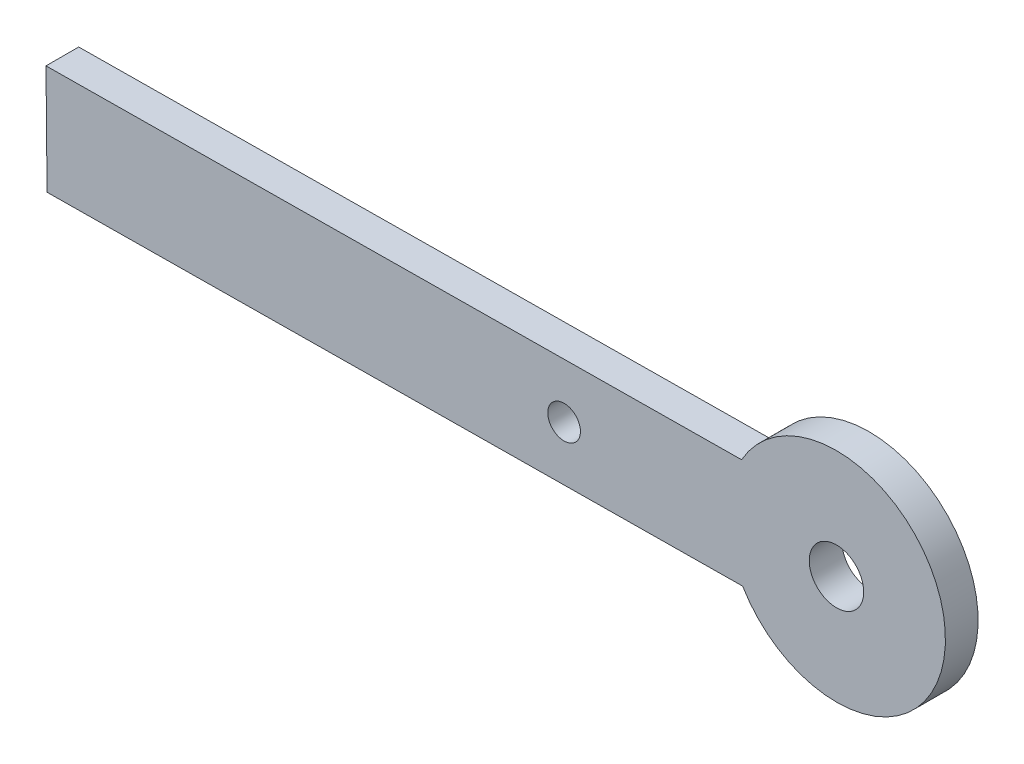
ISO-10303-21;
HEADER;
FILE_DESCRIPTION(('STEP AP214'),'2;1');
FILE_NAME('part.step','',(''),(''),'','','');
FILE_SCHEMA(('AUTOMOTIVE_DESIGN { 1 0 10303 214 1 1 1 1 }'));
ENDSEC;
DATA;
#1=APPLICATION_CONTEXT('core data for automotive mechanical design processes');
#2=APPLICATION_PROTOCOL_DEFINITION('international standard','automotive_design',2000,#1);
#3=PRODUCT_CONTEXT('',#1,'mechanical');
#4=PRODUCT('Part','Part','',(#3));
#5=PRODUCT_RELATED_PRODUCT_CATEGORY('part','',(#4));
#6=PRODUCT_DEFINITION_FORMATION('','',#4);
#7=PRODUCT_DEFINITION_CONTEXT('part definition',#1,'design');
#8=PRODUCT_DEFINITION('design','',#6,#7);
#9=PRODUCT_DEFINITION_SHAPE('','',#8);
#10=(LENGTH_UNIT() NAMED_UNIT(*) SI_UNIT(.MILLI.,.METRE.));
#11=(NAMED_UNIT(*) PLANE_ANGLE_UNIT() SI_UNIT($,.RADIAN.));
#12=(NAMED_UNIT(*) SI_UNIT($,.STERADIAN.) SOLID_ANGLE_UNIT());
#13=UNCERTAINTY_MEASURE_WITH_UNIT(LENGTH_MEASURE(1.E-05),#10,'distance_accuracy_value','');
#14=(GEOMETRIC_REPRESENTATION_CONTEXT(3) GLOBAL_UNCERTAINTY_ASSIGNED_CONTEXT((#13)) GLOBAL_UNIT_ASSIGNED_CONTEXT((#10,
#11,#12)) REPRESENTATION_CONTEXT('',''));
#15=CARTESIAN_POINT('',(0.,0.,0.));
#16=DIRECTION('',(0.,0.,1.));
#17=DIRECTION('',(1.,0.,0.));
#18=AXIS2_PLACEMENT_3D('',#15,#16,#17);
#19=CARTESIAN_POINT('',(35.8035621994973,63.0424851495143,3.));
#20=DIRECTION('',(0.,0.,1.));
#21=DIRECTION('',(1.,0.,0.));
#22=AXIS2_PLACEMENT_3D('',#19,#20,#21);
#23=PLANE('',#22);
#24=CARTESIAN_POINT('',(35.8035621994973,63.0424851495143,3.));
#25=DIRECTION('',(0.,0.,1.));
#26=DIRECTION('',(1.,0.,0.));
#27=AXIS2_PLACEMENT_3D('',#24,#25,#26);
#28=CIRCLE('',#27,2.5);
#29=CARTESIAN_POINT('',(38.3035621994973,63.0424851495143,3.));
#30=VERTEX_POINT('',#29);
#31=EDGE_CURVE('E100',#30,#30,#28,.T.);
#32=ORIENTED_EDGE('',*,*,#31,.F.);
#33=EDGE_LOOP('',(#32));
#34=FACE_BOUND('',#33,.T.);
#35=DIRECTION('',(0.00963700426935661,-0.999953562996158,0.));
#36=VECTOR('',#35,1.);
#37=CARTESIAN_POINT('',(-36.7444747034438,67.3435391362077,3.));
#38=LINE('',#37,#36);
#39=CARTESIAN_POINT('',(-36.7444747034438,67.3435391362077,3.));
#40=VERTEX_POINT('',#39);
#41=CARTESIAN_POINT('',(-36.6481046607503,57.344003506245,3.));
#42=VERTEX_POINT('',#41);
#43=EDGE_CURVE('E85',#40,#42,#38,.T.);
#44=ORIENTED_EDGE('',*,*,#43,.T.);
#45=DIRECTION('',(0.999953562996159,0.00963700426935714,0.));
#46=VECTOR('',#45,1.);
#47=CARTESIAN_POINT('',(-36.6481046607503,57.344003506245,3.));
#48=LINE('',#47,#46);
#49=CARTESIAN_POINT('',(27.1918953392504,57.959258429396,3.));
#50=VERTEX_POINT('',#49);
#51=EDGE_CURVE('E80',#42,#50,#48,.T.);
#52=ORIENTED_EDGE('',*,*,#51,.T.);
#53=CARTESIAN_POINT('',(35.8035621994973,63.0424851495143,3.));
#54=DIRECTION('',(0.,0.,1.));
#55=DIRECTION('',(1.,0.,0.));
#56=AXIS2_PLACEMENT_3D('',#53,#54,#55);
#57=CIRCLE('',#56,10.);
#58=CARTESIAN_POINT('',(27.0955252965562,67.9587940593587,3.));
#59=VERTEX_POINT('',#58);
#60=EDGE_CURVE('E83',#50,#59,#57,.T.);
#61=ORIENTED_EDGE('',*,*,#60,.T.);
#62=DIRECTION('',(-0.999953562996159,-0.00963700426935723,0.));
#63=VECTOR('',#62,1.);
#64=CARTESIAN_POINT('',(-36.7444747034438,67.3435391362077,3.));
#65=LINE('',#64,#63);
#66=EDGE_CURVE('E50',#59,#40,#65,.T.);
#67=ORIENTED_EDGE('',*,*,#66,.T.);
#68=EDGE_LOOP('',(#44,#52,#61,#67));
#69=FACE_BOUND('',#68,.T.);
#70=CARTESIAN_POINT('',(10.8047231245935,62.8015600427804,3.));
#71=DIRECTION('',(0.,0.,1.));
#72=DIRECTION('',(1.,0.,0.));
#73=AXIS2_PLACEMENT_3D('',#70,#71,#72);
#74=CIRCLE('',#73,1.50000000188869);
#75=CARTESIAN_POINT('',(12.3047231264822,62.8015600427804,3.));
#76=VERTEX_POINT('',#75);
#77=EDGE_CURVE('E115',#76,#76,#74,.T.);
#78=ORIENTED_EDGE('',*,*,#77,.F.);
#79=EDGE_LOOP('',(#78));
#80=FACE_BOUND('',#79,.T.);
#81=ADVANCED_FACE('F33',(#34,#69,#80),#23,.T.);
#82=CARTESIAN_POINT('',(35.8035621994973,63.0424851495143,0.));
#83=DIRECTION('',(0.,0.,1.));
#84=DIRECTION('',(1.,0.,0.));
#85=AXIS2_PLACEMENT_3D('',#82,#83,#84);
#86=PLANE('',#85);
#87=DIRECTION('',(0.00963700426935661,-0.999953562996158,0.));
#88=VECTOR('',#87,1.);
#89=CARTESIAN_POINT('',(-36.7444747034438,67.3435391362077,0.));
#90=LINE('',#89,#88);
#91=CARTESIAN_POINT('',(-36.7444747034438,67.3435391362077,0.));
#92=VERTEX_POINT('',#91);
#93=CARTESIAN_POINT('',(-36.6481046607503,57.344003506245,0.));
#94=VERTEX_POINT('',#93);
#95=EDGE_CURVE('E97',#92,#94,#90,.T.);
#96=ORIENTED_EDGE('',*,*,#95,.F.);
#97=DIRECTION('',(-0.999953562996159,-0.00963700426935723,0.));
#98=VECTOR('',#97,1.);
#99=CARTESIAN_POINT('',(-36.7444747034438,67.3435391362077,0.));
#100=LINE('',#99,#98);
#101=CARTESIAN_POINT('',(27.0955252965562,67.9587940593587,0.));
#102=VERTEX_POINT('',#101);
#103=EDGE_CURVE('E73',#102,#92,#100,.T.);
#104=ORIENTED_EDGE('',*,*,#103,.F.);
#105=CARTESIAN_POINT('',(35.8035621994973,63.0424851495143,0.));
#106=DIRECTION('',(0.,0.,1.));
#107=DIRECTION('',(1.,0.,0.));
#108=AXIS2_PLACEMENT_3D('',#105,#106,#107);
#109=CIRCLE('',#108,10.);
#110=CARTESIAN_POINT('',(27.1918953392504,57.959258429396,0.));
#111=VERTEX_POINT('',#110);
#112=EDGE_CURVE('E67',#111,#102,#109,.T.);
#113=ORIENTED_EDGE('',*,*,#112,.F.);
#114=DIRECTION('',(0.999953562996159,0.00963700426935714,0.));
#115=VECTOR('',#114,1.);
#116=CARTESIAN_POINT('',(-36.6481046607503,57.344003506245,0.));
#117=LINE('',#116,#115);
#118=EDGE_CURVE('E89',#94,#111,#117,.T.);
#119=ORIENTED_EDGE('',*,*,#118,.F.);
#120=EDGE_LOOP('',(#96,#104,#113,#119));
#121=FACE_BOUND('',#120,.T.);
#122=CARTESIAN_POINT('',(35.8035621994973,63.0424851495143,0.));
#123=DIRECTION('',(0.,0.,1.));
#124=DIRECTION('',(1.,0.,0.));
#125=AXIS2_PLACEMENT_3D('',#122,#123,#124);
#126=CIRCLE('',#125,2.5);
#127=CARTESIAN_POINT('',(38.3035621994973,63.0424851495143,0.));
#128=VERTEX_POINT('',#127);
#129=EDGE_CURVE('E112',#128,#128,#126,.T.);
#130=ORIENTED_EDGE('',*,*,#129,.T.);
#131=EDGE_LOOP('',(#130));
#132=FACE_BOUND('',#131,.T.);
#133=CARTESIAN_POINT('',(10.8047231245935,62.8015600427804,0.));
#134=DIRECTION('',(0.,0.,1.));
#135=DIRECTION('',(1.,0.,0.));
#136=AXIS2_PLACEMENT_3D('',#133,#134,#135);
#137=CIRCLE('',#136,1.50000000188869);
#138=CARTESIAN_POINT('',(12.3047231264822,62.8015600427804,0.));
#139=VERTEX_POINT('',#138);
#140=EDGE_CURVE('E118',#139,#139,#137,.T.);
#141=ORIENTED_EDGE('',*,*,#140,.T.);
#142=EDGE_LOOP('',(#141));
#143=FACE_BOUND('',#142,.T.);
#144=ADVANCED_FACE('F108',(#121,#132,#143),#86,.F.);
#145=CARTESIAN_POINT('',(-36.7444747034438,67.3435391362077,3.));
#146=DIRECTION('',(0.999953562996159,0.00963700426935661,0.));
#147=DIRECTION('',(-0.00963700426935661,0.999953562996159,0.));
#148=AXIS2_PLACEMENT_3D('',#145,#146,#147);
#149=PLANE('',#148);
#150=ORIENTED_EDGE('',*,*,#95,.T.);
#151=DIRECTION('',(0.,0.,-1.));
#152=VECTOR('',#151,1.);
#153=CARTESIAN_POINT('',(-36.6481046607503,57.344003506245,3.));
#154=LINE('',#153,#152);
#155=EDGE_CURVE('E11',#42,#94,#154,.T.);
#156=ORIENTED_EDGE('',*,*,#155,.F.);
#157=ORIENTED_EDGE('',*,*,#43,.F.);
#158=DIRECTION('',(0.,0.,-1.));
#159=VECTOR('',#158,1.);
#160=CARTESIAN_POINT('',(-36.7444747034438,67.3435391362077,3.));
#161=LINE('',#160,#159);
#162=EDGE_CURVE('E93',#40,#92,#161,.T.);
#163=ORIENTED_EDGE('',*,*,#162,.T.);
#164=EDGE_LOOP('',(#150,#156,#157,#163));
#165=FACE_BOUND('',#164,.T.);
#166=ADVANCED_FACE('F35',(#165),#149,.F.);
#167=CARTESIAN_POINT('',(-36.6481046607503,57.344003506245,3.));
#168=DIRECTION('',(-0.00963700426935714,0.999953562996158,0.));
#169=DIRECTION('',(-0.999953562996159,-0.00963700426935714,0.));
#170=AXIS2_PLACEMENT_3D('',#167,#168,#169);
#171=PLANE('',#170);
#172=ORIENTED_EDGE('',*,*,#118,.T.);
#173=DIRECTION('',(0.,0.,-1.));
#174=VECTOR('',#173,1.);
#175=CARTESIAN_POINT('',(27.1918953392504,57.959258429396,3.));
#176=LINE('',#175,#174);
#177=EDGE_CURVE('E42',#50,#111,#176,.T.);
#178=ORIENTED_EDGE('',*,*,#177,.F.);
#179=ORIENTED_EDGE('',*,*,#51,.F.);
#180=ORIENTED_EDGE('',*,*,#155,.T.);
#181=EDGE_LOOP('',(#172,#178,#179,#180));
#182=FACE_BOUND('',#181,.T.);
#183=ADVANCED_FACE('F88',(#182),#171,.F.);
#184=CARTESIAN_POINT('',(35.8035621994973,63.0424851495143,3.));
#185=DIRECTION('',(0.,0.,-1.));
#186=DIRECTION('',(-1.,0.,0.));
#187=AXIS2_PLACEMENT_3D('',#184,#185,#186);
#188=CYLINDRICAL_SURFACE('',#187,10.);
#189=ORIENTED_EDGE('',*,*,#112,.T.);
#190=DIRECTION('',(0.,0.,-1.));
#191=VECTOR('',#190,1.);
#192=CARTESIAN_POINT('',(27.0955252965562,67.9587940593587,3.));
#193=LINE('',#192,#191);
#194=EDGE_CURVE('E90',#59,#102,#193,.T.);
#195=ORIENTED_EDGE('',*,*,#194,.F.);
#196=ORIENTED_EDGE('',*,*,#60,.F.);
#197=ORIENTED_EDGE('',*,*,#177,.T.);
#198=EDGE_LOOP('',(#189,#195,#196,#197));
#199=FACE_BOUND('',#198,.T.);
#200=ADVANCED_FACE('F91',(#199),#188,.T.);
#201=CARTESIAN_POINT('',(-36.7444747034438,67.3435391362077,3.));
#202=DIRECTION('',(0.00963700426935723,-0.999953562996158,0.));
#203=DIRECTION('',(0.999953562996159,0.00963700426935724,0.));
#204=AXIS2_PLACEMENT_3D('',#201,#202,#203);
#205=PLANE('',#204);
#206=ORIENTED_EDGE('',*,*,#103,.T.);
#207=ORIENTED_EDGE('',*,*,#162,.F.);
#208=ORIENTED_EDGE('',*,*,#66,.F.);
#209=ORIENTED_EDGE('',*,*,#194,.T.);
#210=EDGE_LOOP('',(#206,#207,#208,#209));
#211=FACE_BOUND('',#210,.T.);
#212=ADVANCED_FACE('F105',(#211),#205,.F.);
#213=CARTESIAN_POINT('',(35.8035621994973,63.0424851495143,3.));
#214=DIRECTION('',(0.,0.,-1.));
#215=DIRECTION('',(-1.,0.,0.));
#216=AXIS2_PLACEMENT_3D('',#213,#214,#215);
#217=CYLINDRICAL_SURFACE('',#216,2.5);
#218=ORIENTED_EDGE('',*,*,#31,.T.);
#219=EDGE_LOOP('',(#218));
#220=FACE_BOUND('',#219,.T.);
#221=ORIENTED_EDGE('',*,*,#129,.F.);
#222=EDGE_LOOP('',(#221));
#223=FACE_BOUND('',#222,.T.);
#224=ADVANCED_FACE('F135',(#220,#223),#217,.F.);
#225=CARTESIAN_POINT('',(10.8047231245935,62.8015600427804,3.));
#226=DIRECTION('',(0.,0.,-1.));
#227=DIRECTION('',(-1.,0.,0.));
#228=AXIS2_PLACEMENT_3D('',#225,#226,#227);
#229=CYLINDRICAL_SURFACE('',#228,1.50000000188869);
#230=ORIENTED_EDGE('',*,*,#77,.T.);
#231=EDGE_LOOP('',(#230));
#232=FACE_BOUND('',#231,.T.);
#233=ORIENTED_EDGE('',*,*,#140,.F.);
#234=EDGE_LOOP('',(#233));
#235=FACE_BOUND('',#234,.T.);
#236=ADVANCED_FACE('F124',(#232,#235),#229,.F.);
#237=CLOSED_SHELL('',(#81,#144,#166,#183,#200,#212,#224,#236));
#238=MANIFOLD_SOLID_BREP('B2',#237);
#239=ADVANCED_BREP_SHAPE_REPRESENTATION('',(#18,#238),#14);
#240=SHAPE_DEFINITION_REPRESENTATION(#9,#239);
ENDSEC;
END-ISO-10303-21;
